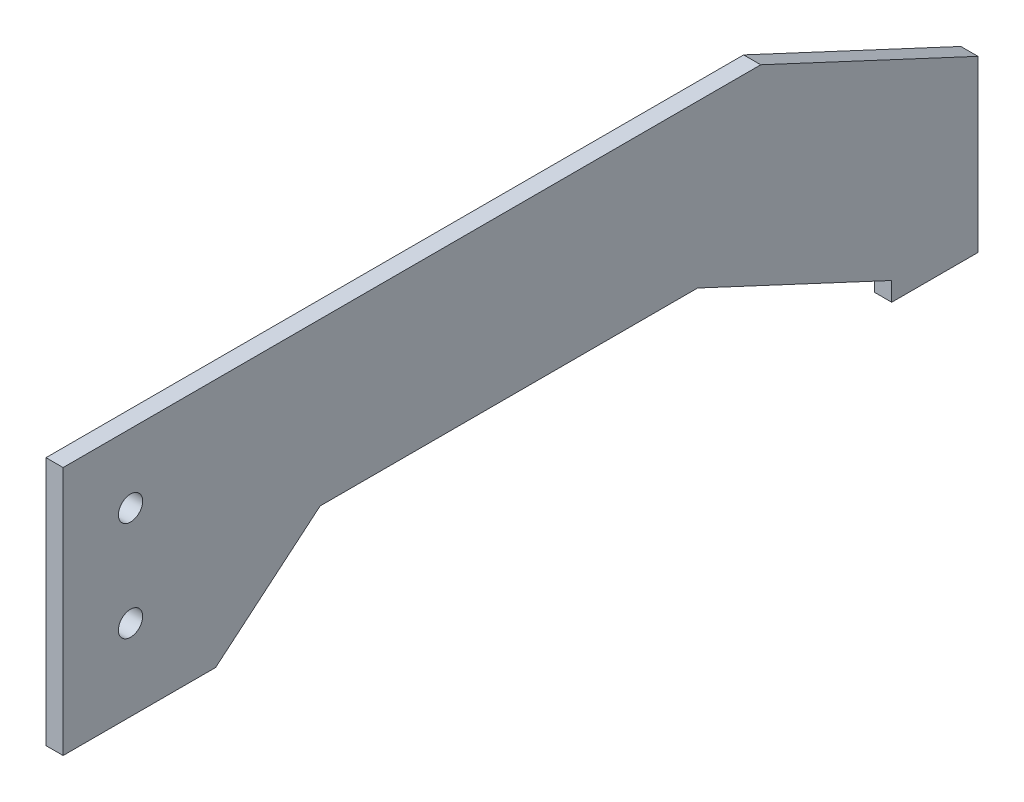
ISO-10303-21;
HEADER;
FILE_DESCRIPTION(('STEP AP214'),'2;1');
FILE_NAME('part.step','',(''),(''),'','','');
FILE_SCHEMA(('AUTOMOTIVE_DESIGN { 1 0 10303 214 1 1 1 1 }'));
ENDSEC;
DATA;
#1=APPLICATION_CONTEXT('core data for automotive mechanical design processes');
#2=APPLICATION_PROTOCOL_DEFINITION('international standard','automotive_design',2000,#1);
#3=PRODUCT_CONTEXT('',#1,'mechanical');
#4=PRODUCT('Part','Part','',(#3));
#5=PRODUCT_RELATED_PRODUCT_CATEGORY('part','',(#4));
#6=PRODUCT_DEFINITION_FORMATION('','',#4);
#7=PRODUCT_DEFINITION_CONTEXT('part definition',#1,'design');
#8=PRODUCT_DEFINITION('design','',#6,#7);
#9=PRODUCT_DEFINITION_SHAPE('','',#8);
#10=(LENGTH_UNIT() NAMED_UNIT(*) SI_UNIT(.MILLI.,.METRE.));
#11=(NAMED_UNIT(*) PLANE_ANGLE_UNIT() SI_UNIT($,.RADIAN.));
#12=(NAMED_UNIT(*) SI_UNIT($,.STERADIAN.) SOLID_ANGLE_UNIT());
#13=UNCERTAINTY_MEASURE_WITH_UNIT(LENGTH_MEASURE(1.E-05),#10,'distance_accuracy_value','');
#14=(GEOMETRIC_REPRESENTATION_CONTEXT(3) GLOBAL_UNCERTAINTY_ASSIGNED_CONTEXT((#13)) GLOBAL_UNIT_ASSIGNED_CONTEXT((#10,
#11,#12)) REPRESENTATION_CONTEXT('',''));
#15=CARTESIAN_POINT('',(0.,0.,0.));
#16=DIRECTION('',(0.,0.,1.));
#17=DIRECTION('',(1.,0.,0.));
#18=AXIS2_PLACEMENT_3D('',#15,#16,#17);
#19=CARTESIAN_POINT('',(3.175,0.,0.));
#20=DIRECTION('',(-1.,0.,0.));
#21=DIRECTION('',(0.,0.,1.));
#22=AXIS2_PLACEMENT_3D('',#19,#20,#21);
#23=PLANE('',#22);
#24=DIRECTION('',(0.,-0.422618261740697,-0.906307787036651));
#25=VECTOR('',#24,1.);
#26=CARTESIAN_POINT('',(3.175,-48.0060431996153,-83.6115260426494));
#27=LINE('',#26,#25);
#28=CARTESIAN_POINT('',(3.175,-31.2189675060355,-47.6115260426494));
#29=VERTEX_POINT('',#28);
#30=CARTESIAN_POINT('',(3.175,-48.0060431996153,-83.6115260426494));
#31=VERTEX_POINT('',#30);
#32=EDGE_CURVE('E160',#29,#31,#27,.T.);
#33=ORIENTED_EDGE('',*,*,#32,.T.);
#34=DIRECTION('',(0.,-1.,0.));
#35=VECTOR('',#34,1.);
#36=CARTESIAN_POINT('',(3.175,-51.5060431996153,-83.6115260426494));
#37=LINE('',#36,#35);
#38=CARTESIAN_POINT('',(3.175,-51.5060431996153,-83.6115260426494));
#39=VERTEX_POINT('',#38);
#40=EDGE_CURVE('E98',#31,#39,#37,.T.);
#41=ORIENTED_EDGE('',*,*,#40,.T.);
#42=DIRECTION('',(0.,0.,-1.));
#43=VECTOR('',#42,1.);
#44=CARTESIAN_POINT('',(3.175,-51.5060431996153,-99.6115260426493));
#45=LINE('',#44,#43);
#46=CARTESIAN_POINT('',(3.175,-51.5060431996153,-99.6115260426493));
#47=VERTEX_POINT('',#46);
#48=EDGE_CURVE('E181',#39,#47,#45,.T.);
#49=ORIENTED_EDGE('',*,*,#48,.T.);
#50=DIRECTION('',(0.,1.,0.));
#51=VECTOR('',#50,1.);
#52=CARTESIAN_POINT('',(3.175,-51.5060431996153,-99.6115260426493));
#53=LINE('',#52,#51);
#54=CARTESIAN_POINT('',(3.175,-20.0060431996153,-99.6115260426493));
#55=VERTEX_POINT('',#54);
#56=EDGE_CURVE('E200',#47,#55,#53,.T.);
#57=ORIENTED_EDGE('',*,*,#56,.T.);
#58=DIRECTION('',(0.,0.422618261740697,0.906307787036651));
#59=VECTOR('',#58,1.);
#60=CARTESIAN_POINT('',(3.175,-20.0060431996153,-99.6115260426493));
#61=LINE('',#60,#59);
#62=CARTESIAN_POINT('',(3.175,-1.21896750603553,-59.3225122016302));
#63=VERTEX_POINT('',#62);
#64=EDGE_CURVE('E197',#55,#63,#61,.T.);
#65=ORIENTED_EDGE('',*,*,#64,.T.);
#66=DIRECTION('',(0.,0.,1.));
#67=VECTOR('',#66,1.);
#68=CARTESIAN_POINT('',(3.175,-1.21896750603553,70.0390730780112));
#69=LINE('',#68,#67);
#70=CARTESIAN_POINT('',(3.175,-1.21896750603553,70.0390730780112));
#71=VERTEX_POINT('',#70);
#72=EDGE_CURVE('E199',#63,#71,#69,.T.);
#73=ORIENTED_EDGE('',*,*,#72,.T.);
#74=DIRECTION('',(0.,-1.,0.));
#75=VECTOR('',#74,1.);
#76=CARTESIAN_POINT('',(3.175,-1.21896750603553,70.0390730780112));
#77=LINE('',#76,#75);
#78=CARTESIAN_POINT('',(3.175,-47.4723713948807,70.0390730780112));
#79=VERTEX_POINT('',#78);
#80=EDGE_CURVE('E123',#71,#79,#77,.T.);
#81=ORIENTED_EDGE('',*,*,#80,.T.);
#82=DIRECTION('',(0.,0.,-1.));
#83=VECTOR('',#82,1.);
#84=CARTESIAN_POINT('',(3.175,-47.4723713948807,70.0390730780112));
#85=LINE('',#84,#83);
#86=CARTESIAN_POINT('',(3.175,-47.4723713948807,41.7585264337668));
#87=VERTEX_POINT('',#86);
#88=EDGE_CURVE('E117',#79,#87,#85,.T.);
#89=ORIENTED_EDGE('',*,*,#88,.T.);
#90=DIRECTION('',(0.,0.642787609686535,-0.766044443118982));
#91=VECTOR('',#90,1.);
#92=CARTESIAN_POINT('',(3.175,-47.4723713948807,41.7585264337668));
#93=LINE('',#92,#91);
#94=CARTESIAN_POINT('',(3.175,-31.2189675060355,22.3884739573506));
#95=VERTEX_POINT('',#94);
#96=EDGE_CURVE('E121',#87,#95,#93,.T.);
#97=ORIENTED_EDGE('',*,*,#96,.T.);
#98=DIRECTION('',(0.,0.,-1.));
#99=VECTOR('',#98,1.);
#100=CARTESIAN_POINT('',(3.175,-31.2189675060355,22.3884739573506));
#101=LINE('',#100,#99);
#102=EDGE_CURVE('E49',#95,#29,#101,.T.);
#103=ORIENTED_EDGE('',*,*,#102,.T.);
#104=EDGE_LOOP('',(#33,#41,#49,#57,#65,#73,#81,#89,#97,#103));
#105=FACE_BOUND('',#104,.T.);
#106=CARTESIAN_POINT('',(3.175,-13.9723713948807,57.5384739573507));
#107=DIRECTION('',(1.,0.,0.));
#108=DIRECTION('',(0.,0.,-1.));
#109=AXIS2_PLACEMENT_3D('',#106,#107,#108);
#110=CIRCLE('',#109,2.25);
#111=CARTESIAN_POINT('',(3.175,-13.9723713948807,55.2884739573507));
#112=VERTEX_POINT('',#111);
#113=EDGE_CURVE('E145',#112,#112,#110,.T.);
#114=ORIENTED_EDGE('',*,*,#113,.F.);
#115=EDGE_LOOP('',(#114));
#116=FACE_BOUND('',#115,.T.);
#117=CARTESIAN_POINT('',(3.175,-32.4723713948807,57.5384739573507));
#118=DIRECTION('',(1.,0.,0.));
#119=DIRECTION('',(0.,0.,-1.));
#120=AXIS2_PLACEMENT_3D('',#117,#118,#119);
#121=CIRCLE('',#120,2.25);
#122=CARTESIAN_POINT('',(3.175,-32.4723713948807,55.2884739573507));
#123=VERTEX_POINT('',#122);
#124=EDGE_CURVE('E211',#123,#123,#121,.T.);
#125=ORIENTED_EDGE('',*,*,#124,.F.);
#126=EDGE_LOOP('',(#125));
#127=FACE_BOUND('',#126,.T.);
#128=ADVANCED_FACE('F32',(#105,#116,#127),#23,.F.);
#129=CARTESIAN_POINT('',(0.,0.,0.));
#130=DIRECTION('',(-1.,0.,0.));
#131=DIRECTION('',(0.,0.,1.));
#132=AXIS2_PLACEMENT_3D('',#129,#130,#131);
#133=PLANE('',#132);
#134=CARTESIAN_POINT('',(0.,-13.9723713948807,57.5384739573507));
#135=DIRECTION('',(1.,0.,0.));
#136=DIRECTION('',(0.,0.,-1.));
#137=AXIS2_PLACEMENT_3D('',#134,#135,#136);
#138=CIRCLE('',#137,2.25);
#139=CARTESIAN_POINT('',(0.,-13.9723713948807,55.2884739573507));
#140=VERTEX_POINT('',#139);
#141=EDGE_CURVE('E208',#140,#140,#138,.T.);
#142=ORIENTED_EDGE('',*,*,#141,.T.);
#143=EDGE_LOOP('',(#142));
#144=FACE_BOUND('',#143,.T.);
#145=DIRECTION('',(0.,-0.422618261740697,-0.906307787036651));
#146=VECTOR('',#145,1.);
#147=CARTESIAN_POINT('',(0.,-48.0060431996153,-83.6115260426494));
#148=LINE('',#147,#146);
#149=CARTESIAN_POINT('',(0.,-31.2189675060355,-47.6115260426494));
#150=VERTEX_POINT('',#149);
#151=CARTESIAN_POINT('',(0.,-48.0060431996153,-83.6115260426494));
#152=VERTEX_POINT('',#151);
#153=EDGE_CURVE('E141',#150,#152,#148,.T.);
#154=ORIENTED_EDGE('',*,*,#153,.F.);
#155=DIRECTION('',(0.,0.,-1.));
#156=VECTOR('',#155,1.);
#157=CARTESIAN_POINT('',(0.,-31.2189675060355,22.3884739573506));
#158=LINE('',#157,#156);
#159=CARTESIAN_POINT('',(0.,-31.2189675060355,22.3884739573506));
#160=VERTEX_POINT('',#159);
#161=EDGE_CURVE('E90',#160,#150,#158,.T.);
#162=ORIENTED_EDGE('',*,*,#161,.F.);
#163=DIRECTION('',(0.,0.642787609686535,-0.766044443118982));
#164=VECTOR('',#163,1.);
#165=CARTESIAN_POINT('',(0.,-47.4723713948807,41.7585264337668));
#166=LINE('',#165,#164);
#167=CARTESIAN_POINT('',(0.,-47.4723713948807,41.7585264337668));
#168=VERTEX_POINT('',#167);
#169=EDGE_CURVE('E84',#168,#160,#166,.T.);
#170=ORIENTED_EDGE('',*,*,#169,.F.);
#171=DIRECTION('',(0.,0.,-1.));
#172=VECTOR('',#171,1.);
#173=CARTESIAN_POINT('',(0.,-47.4723713948807,70.0390730780112));
#174=LINE('',#173,#172);
#175=CARTESIAN_POINT('',(0.,-47.4723713948807,70.0390730780112));
#176=VERTEX_POINT('',#175);
#177=EDGE_CURVE('E131',#176,#168,#174,.T.);
#178=ORIENTED_EDGE('',*,*,#177,.F.);
#179=DIRECTION('',(0.,-1.,0.));
#180=VECTOR('',#179,1.);
#181=CARTESIAN_POINT('',(0.,-1.21896750603553,70.0390730780112));
#182=LINE('',#181,#180);
#183=CARTESIAN_POINT('',(0.,-1.21896750603553,70.0390730780112));
#184=VERTEX_POINT('',#183);
#185=EDGE_CURVE('E155',#184,#176,#182,.T.);
#186=ORIENTED_EDGE('',*,*,#185,.F.);
#187=DIRECTION('',(0.,0.,1.));
#188=VECTOR('',#187,1.);
#189=CARTESIAN_POINT('',(0.,-1.21896750603553,70.0390730780112));
#190=LINE('',#189,#188);
#191=CARTESIAN_POINT('',(0.,-1.21896750603553,-59.3225122016302));
#192=VERTEX_POINT('',#191);
#193=EDGE_CURVE('E153',#192,#184,#190,.T.);
#194=ORIENTED_EDGE('',*,*,#193,.F.);
#195=DIRECTION('',(0.,0.422618261740697,0.906307787036651));
#196=VECTOR('',#195,1.);
#197=CARTESIAN_POINT('',(0.,-20.0060431996153,-99.6115260426493));
#198=LINE('',#197,#196);
#199=CARTESIAN_POINT('',(0.,-20.0060431996153,-99.6115260426493));
#200=VERTEX_POINT('',#199);
#201=EDGE_CURVE('E151',#200,#192,#198,.T.);
#202=ORIENTED_EDGE('',*,*,#201,.F.);
#203=DIRECTION('',(0.,1.,0.));
#204=VECTOR('',#203,1.);
#205=CARTESIAN_POINT('',(0.,-51.5060431996153,-99.6115260426493));
#206=LINE('',#205,#204);
#207=CARTESIAN_POINT('',(0.,-51.5060431996153,-99.6115260426493));
#208=VERTEX_POINT('',#207);
#209=EDGE_CURVE('E149',#208,#200,#206,.T.);
#210=ORIENTED_EDGE('',*,*,#209,.F.);
#211=DIRECTION('',(0.,0.,-1.));
#212=VECTOR('',#211,1.);
#213=CARTESIAN_POINT('',(0.,-51.5060431996153,-99.6115260426493));
#214=LINE('',#213,#212);
#215=CARTESIAN_POINT('',(0.,-51.5060431996153,-83.6115260426494));
#216=VERTEX_POINT('',#215);
#217=EDGE_CURVE('E147',#216,#208,#214,.T.);
#218=ORIENTED_EDGE('',*,*,#217,.F.);
#219=DIRECTION('',(0.,-1.,0.));
#220=VECTOR('',#219,1.);
#221=CARTESIAN_POINT('',(0.,-51.5060431996153,-83.6115260426494));
#222=LINE('',#221,#220);
#223=EDGE_CURVE('E144',#152,#216,#222,.T.);
#224=ORIENTED_EDGE('',*,*,#223,.F.);
#225=EDGE_LOOP('',(#154,#162,#170,#178,#186,#194,#202,#210,#218,#224));
#226=FACE_BOUND('',#225,.T.);
#227=CARTESIAN_POINT('',(0.,-32.4723713948807,57.5384739573507));
#228=DIRECTION('',(1.,0.,0.));
#229=DIRECTION('',(0.,0.,-1.));
#230=AXIS2_PLACEMENT_3D('',#227,#228,#229);
#231=CIRCLE('',#230,2.25);
#232=CARTESIAN_POINT('',(0.,-32.4723713948807,55.2884739573507));
#233=VERTEX_POINT('',#232);
#234=EDGE_CURVE('E214',#233,#233,#231,.T.);
#235=ORIENTED_EDGE('',*,*,#234,.T.);
#236=EDGE_LOOP('',(#235));
#237=FACE_BOUND('',#236,.T.);
#238=ADVANCED_FACE('F185',(#144,#226,#237),#133,.T.);
#239=CARTESIAN_POINT('',(3.175,-48.0060431996153,-83.6115260426494));
#240=DIRECTION('',(0.,0.906307787036651,-0.422618261740697));
#241=DIRECTION('',(0.,0.422618261740697,0.906307787036651));
#242=AXIS2_PLACEMENT_3D('',#239,#240,#241);
#243=PLANE('',#242);
#244=ORIENTED_EDGE('',*,*,#153,.T.);
#245=DIRECTION('',(-1.,0.,0.));
#246=VECTOR('',#245,1.);
#247=CARTESIAN_POINT('',(3.175,-48.0060431996153,-83.6115260426494));
#248=LINE('',#247,#246);
#249=EDGE_CURVE('E11',#31,#152,#248,.T.);
#250=ORIENTED_EDGE('',*,*,#249,.F.);
#251=ORIENTED_EDGE('',*,*,#32,.F.);
#252=DIRECTION('',(-1.,0.,0.));
#253=VECTOR('',#252,1.);
#254=CARTESIAN_POINT('',(3.175,-31.2189675060355,-47.6115260426494));
#255=LINE('',#254,#253);
#256=EDGE_CURVE('E137',#29,#150,#255,.T.);
#257=ORIENTED_EDGE('',*,*,#256,.T.);
#258=EDGE_LOOP('',(#244,#250,#251,#257));
#259=FACE_BOUND('',#258,.T.);
#260=ADVANCED_FACE('F34',(#259),#243,.F.);
#261=CARTESIAN_POINT('',(3.175,-51.5060431996153,-83.6115260426494));
#262=DIRECTION('',(0.,0.,-1.));
#263=DIRECTION('',(-1.,0.,0.));
#264=AXIS2_PLACEMENT_3D('',#261,#262,#263);
#265=PLANE('',#264);
#266=ORIENTED_EDGE('',*,*,#223,.T.);
#267=DIRECTION('',(-1.,0.,0.));
#268=VECTOR('',#267,1.);
#269=CARTESIAN_POINT('',(3.175,-51.5060431996153,-83.6115260426494));
#270=LINE('',#269,#268);
#271=EDGE_CURVE('E41',#39,#216,#270,.T.);
#272=ORIENTED_EDGE('',*,*,#271,.F.);
#273=ORIENTED_EDGE('',*,*,#40,.F.);
#274=ORIENTED_EDGE('',*,*,#249,.T.);
#275=EDGE_LOOP('',(#266,#272,#273,#274));
#276=FACE_BOUND('',#275,.T.);
#277=ADVANCED_FACE('F254',(#276),#265,.F.);
#278=CARTESIAN_POINT('',(3.175,-51.5060431996153,-99.6115260426493));
#279=DIRECTION('',(0.,1.,0.));
#280=DIRECTION('',(0.,0.,1.));
#281=AXIS2_PLACEMENT_3D('',#278,#279,#280);
#282=PLANE('',#281);
#283=ORIENTED_EDGE('',*,*,#217,.T.);
#284=DIRECTION('',(-1.,0.,0.));
#285=VECTOR('',#284,1.);
#286=CARTESIAN_POINT('',(3.175,-51.5060431996153,-99.6115260426493));
#287=LINE('',#286,#285);
#288=EDGE_CURVE('E173',#47,#208,#287,.T.);
#289=ORIENTED_EDGE('',*,*,#288,.F.);
#290=ORIENTED_EDGE('',*,*,#48,.F.);
#291=ORIENTED_EDGE('',*,*,#271,.T.);
#292=EDGE_LOOP('',(#283,#289,#290,#291));
#293=FACE_BOUND('',#292,.T.);
#294=ADVANCED_FACE('F179',(#293),#282,.F.);
#295=CARTESIAN_POINT('',(3.175,-51.5060431996153,-99.6115260426493));
#296=DIRECTION('',(0.,0.,1.));
#297=DIRECTION('',(1.,0.,0.));
#298=AXIS2_PLACEMENT_3D('',#295,#296,#297);
#299=PLANE('',#298);
#300=ORIENTED_EDGE('',*,*,#209,.T.);
#301=DIRECTION('',(-1.,0.,0.));
#302=VECTOR('',#301,1.);
#303=CARTESIAN_POINT('',(3.175,-20.0060431996153,-99.6115260426493));
#304=LINE('',#303,#302);
#305=EDGE_CURVE('E170',#55,#200,#304,.T.);
#306=ORIENTED_EDGE('',*,*,#305,.F.);
#307=ORIENTED_EDGE('',*,*,#56,.F.);
#308=ORIENTED_EDGE('',*,*,#288,.T.);
#309=EDGE_LOOP('',(#300,#306,#307,#308));
#310=FACE_BOUND('',#309,.T.);
#311=ADVANCED_FACE('F191',(#310),#299,.F.);
#312=CARTESIAN_POINT('',(3.175,-20.0060431996153,-99.6115260426493));
#313=DIRECTION('',(0.,-0.906307787036651,0.422618261740697));
#314=DIRECTION('',(0.,-0.422618261740697,-0.906307787036651));
#315=AXIS2_PLACEMENT_3D('',#312,#313,#314);
#316=PLANE('',#315);
#317=ORIENTED_EDGE('',*,*,#201,.T.);
#318=DIRECTION('',(-1.,0.,0.));
#319=VECTOR('',#318,1.);
#320=CARTESIAN_POINT('',(3.175,-1.21896750603553,-59.3225122016302));
#321=LINE('',#320,#319);
#322=EDGE_CURVE('E167',#63,#192,#321,.T.);
#323=ORIENTED_EDGE('',*,*,#322,.F.);
#324=ORIENTED_EDGE('',*,*,#64,.F.);
#325=ORIENTED_EDGE('',*,*,#305,.T.);
#326=EDGE_LOOP('',(#317,#323,#324,#325));
#327=FACE_BOUND('',#326,.T.);
#328=ADVANCED_FACE('F195',(#327),#316,.F.);
#329=CARTESIAN_POINT('',(3.175,-1.21896750603553,70.0390730780112));
#330=DIRECTION('',(0.,-1.,0.));
#331=DIRECTION('',(0.,0.,-1.));
#332=AXIS2_PLACEMENT_3D('',#329,#330,#331);
#333=PLANE('',#332);
#334=ORIENTED_EDGE('',*,*,#193,.T.);
#335=DIRECTION('',(-1.,0.,0.));
#336=VECTOR('',#335,1.);
#337=CARTESIAN_POINT('',(3.175,-1.21896750603553,70.0390730780112));
#338=LINE('',#337,#336);
#339=EDGE_CURVE('E164',#71,#184,#338,.T.);
#340=ORIENTED_EDGE('',*,*,#339,.F.);
#341=ORIENTED_EDGE('',*,*,#72,.F.);
#342=ORIENTED_EDGE('',*,*,#322,.T.);
#343=EDGE_LOOP('',(#334,#340,#341,#342));
#344=FACE_BOUND('',#343,.T.);
#345=ADVANCED_FACE('F244',(#344),#333,.F.);
#346=CARTESIAN_POINT('',(3.175,-1.21896750603553,70.0390730780112));
#347=DIRECTION('',(0.,0.,-1.));
#348=DIRECTION('',(-1.,0.,0.));
#349=AXIS2_PLACEMENT_3D('',#346,#347,#348);
#350=PLANE('',#349);
#351=ORIENTED_EDGE('',*,*,#185,.T.);
#352=DIRECTION('',(-1.,0.,0.));
#353=VECTOR('',#352,1.);
#354=CARTESIAN_POINT('',(3.175,-47.4723713948807,70.0390730780112));
#355=LINE('',#354,#353);
#356=EDGE_CURVE('E132',#79,#176,#355,.T.);
#357=ORIENTED_EDGE('',*,*,#356,.F.);
#358=ORIENTED_EDGE('',*,*,#80,.F.);
#359=ORIENTED_EDGE('',*,*,#339,.T.);
#360=EDGE_LOOP('',(#351,#357,#358,#359));
#361=FACE_BOUND('',#360,.T.);
#362=ADVANCED_FACE('F241',(#361),#350,.F.);
#363=CARTESIAN_POINT('',(3.175,-47.4723713948807,70.0390730780112));
#364=DIRECTION('',(0.,1.,0.));
#365=DIRECTION('',(0.,0.,1.));
#366=AXIS2_PLACEMENT_3D('',#363,#364,#365);
#367=PLANE('',#366);
#368=ORIENTED_EDGE('',*,*,#177,.T.);
#369=DIRECTION('',(-1.,0.,0.));
#370=VECTOR('',#369,1.);
#371=CARTESIAN_POINT('',(3.175,-47.4723713948807,41.7585264337668));
#372=LINE('',#371,#370);
#373=EDGE_CURVE('E128',#87,#168,#372,.T.);
#374=ORIENTED_EDGE('',*,*,#373,.F.);
#375=ORIENTED_EDGE('',*,*,#88,.F.);
#376=ORIENTED_EDGE('',*,*,#356,.T.);
#377=EDGE_LOOP('',(#368,#374,#375,#376));
#378=FACE_BOUND('',#377,.T.);
#379=ADVANCED_FACE('F129',(#378),#367,.F.);
#380=CARTESIAN_POINT('',(3.175,-47.4723713948807,41.7585264337668));
#381=DIRECTION('',(0.,0.766044443118982,0.642787609686535));
#382=DIRECTION('',(0.,-0.642787609686535,0.766044443118982));
#383=AXIS2_PLACEMENT_3D('',#380,#381,#382);
#384=PLANE('',#383);
#385=ORIENTED_EDGE('',*,*,#169,.T.);
#386=DIRECTION('',(-1.,0.,0.));
#387=VECTOR('',#386,1.);
#388=CARTESIAN_POINT('',(3.175,-31.2189675060355,22.3884739573506));
#389=LINE('',#388,#387);
#390=EDGE_CURVE('E133',#95,#160,#389,.T.);
#391=ORIENTED_EDGE('',*,*,#390,.F.);
#392=ORIENTED_EDGE('',*,*,#96,.F.);
#393=ORIENTED_EDGE('',*,*,#373,.T.);
#394=EDGE_LOOP('',(#385,#391,#392,#393));
#395=FACE_BOUND('',#394,.T.);
#396=ADVANCED_FACE('F135',(#395),#384,.F.);
#397=CARTESIAN_POINT('',(3.175,-31.2189675060355,22.3884739573506));
#398=DIRECTION('',(0.,1.,0.));
#399=DIRECTION('',(0.,0.,1.));
#400=AXIS2_PLACEMENT_3D('',#397,#398,#399);
#401=PLANE('',#400);
#402=ORIENTED_EDGE('',*,*,#161,.T.);
#403=ORIENTED_EDGE('',*,*,#256,.F.);
#404=ORIENTED_EDGE('',*,*,#102,.F.);
#405=ORIENTED_EDGE('',*,*,#390,.T.);
#406=EDGE_LOOP('',(#402,#403,#404,#405));
#407=FACE_BOUND('',#406,.T.);
#408=ADVANCED_FACE('F234',(#407),#401,.F.);
#409=CARTESIAN_POINT('',(3.175,-13.9723713948807,57.5384739573507));
#410=DIRECTION('',(-1.,0.,0.));
#411=DIRECTION('',(0.,0.,1.));
#412=AXIS2_PLACEMENT_3D('',#409,#410,#411);
#413=CYLINDRICAL_SURFACE('',#412,2.25);
#414=ORIENTED_EDGE('',*,*,#113,.T.);
#415=EDGE_LOOP('',(#414));
#416=FACE_BOUND('',#415,.T.);
#417=ORIENTED_EDGE('',*,*,#141,.F.);
#418=EDGE_LOOP('',(#417));
#419=FACE_BOUND('',#418,.T.);
#420=ADVANCED_FACE('F231',(#416,#419),#413,.F.);
#421=CARTESIAN_POINT('',(3.175,-32.4723713948807,57.5384739573507));
#422=DIRECTION('',(-1.,0.,0.));
#423=DIRECTION('',(0.,0.,1.));
#424=AXIS2_PLACEMENT_3D('',#421,#422,#423);
#425=CYLINDRICAL_SURFACE('',#424,2.25);
#426=ORIENTED_EDGE('',*,*,#124,.T.);
#427=EDGE_LOOP('',(#426));
#428=FACE_BOUND('',#427,.T.);
#429=ORIENTED_EDGE('',*,*,#234,.F.);
#430=EDGE_LOOP('',(#429));
#431=FACE_BOUND('',#430,.T.);
#432=ADVANCED_FACE('F220',(#428,#431),#425,.F.);
#433=CLOSED_SHELL('',(#128,#238,#260,#277,#294,#311,#328,#345,#362,#379,#396,#408,#420,#432));
#434=MANIFOLD_SOLID_BREP('B2',#433);
#435=ADVANCED_BREP_SHAPE_REPRESENTATION('',(#18,#434),#14);
#436=SHAPE_DEFINITION_REPRESENTATION(#9,#435);
ENDSEC;
END-ISO-10303-21;
